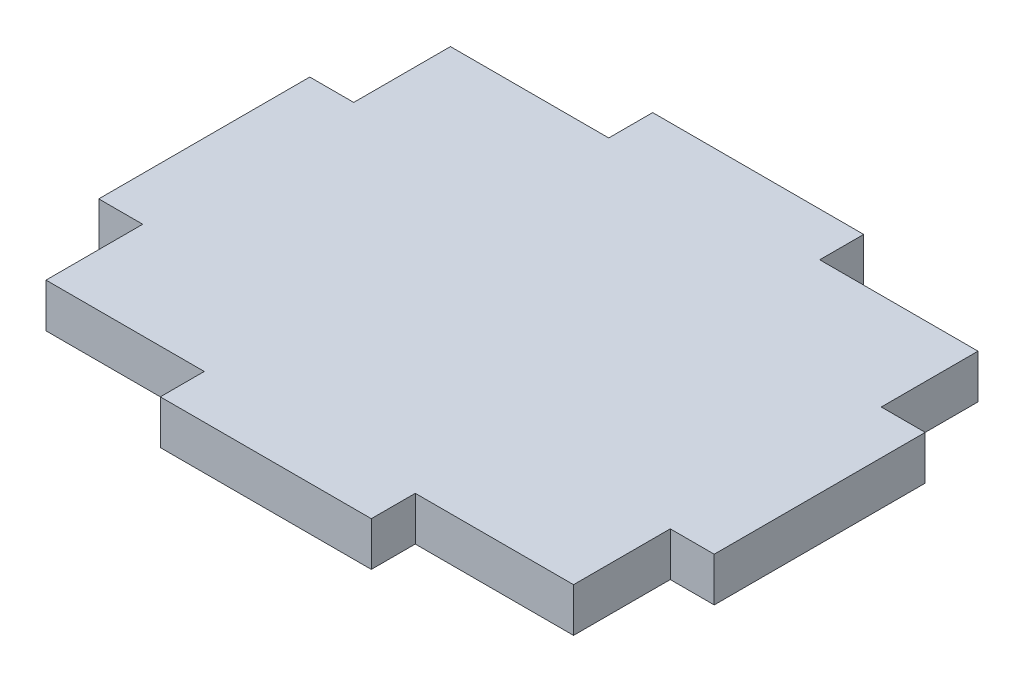
ISO-10303-21;
HEADER;
FILE_DESCRIPTION(('STEP AP214'),'2;1');
FILE_NAME('part.step','',(''),(''),'','','');
FILE_SCHEMA(('AUTOMOTIVE_DESIGN { 1 0 10303 214 1 1 1 1 }'));
ENDSEC;
DATA;
#1=APPLICATION_CONTEXT('core data for automotive mechanical design processes');
#2=APPLICATION_PROTOCOL_DEFINITION('international standard','automotive_design',2000,#1);
#3=PRODUCT_CONTEXT('',#1,'mechanical');
#4=PRODUCT('Part','Part','',(#3));
#5=PRODUCT_RELATED_PRODUCT_CATEGORY('part','',(#4));
#6=PRODUCT_DEFINITION_FORMATION('','',#4);
#7=PRODUCT_DEFINITION_CONTEXT('part definition',#1,'design');
#8=PRODUCT_DEFINITION('design','',#6,#7);
#9=PRODUCT_DEFINITION_SHAPE('','',#8);
#10=(LENGTH_UNIT() NAMED_UNIT(*) SI_UNIT(.MILLI.,.METRE.));
#11=(NAMED_UNIT(*) PLANE_ANGLE_UNIT() SI_UNIT($,.RADIAN.));
#12=(NAMED_UNIT(*) SI_UNIT($,.STERADIAN.) SOLID_ANGLE_UNIT());
#13=UNCERTAINTY_MEASURE_WITH_UNIT(LENGTH_MEASURE(1.E-05),#10,'distance_accuracy_value','');
#14=(GEOMETRIC_REPRESENTATION_CONTEXT(3) GLOBAL_UNCERTAINTY_ASSIGNED_CONTEXT((#13)) GLOBAL_UNIT_ASSIGNED_CONTEXT((#10,
#11,#12)) REPRESENTATION_CONTEXT('',''));
#15=CARTESIAN_POINT('',(0.,0.,0.));
#16=DIRECTION('',(0.,0.,1.));
#17=DIRECTION('',(1.,0.,0.));
#18=AXIS2_PLACEMENT_3D('',#15,#16,#17);
#19=CARTESIAN_POINT('',(0.,6.35,0.));
#20=DIRECTION('',(-1.,0.,0.));
#21=DIRECTION('',(0.,0.,1.));
#22=AXIS2_PLACEMENT_3D('',#19,#20,#21);
#23=PLANE('',#22);
#24=DIRECTION('',(0.,1.,0.));
#25=VECTOR('',#24,1.);
#26=CARTESIAN_POINT('',(0.,0.,13.97));
#27=LINE('',#26,#25);
#28=CARTESIAN_POINT('',(0.,0.,13.97));
#29=VERTEX_POINT('',#28);
#30=CARTESIAN_POINT('',(0.,6.35,13.97));
#31=VERTEX_POINT('',#30);
#32=EDGE_CURVE('E381',#29,#31,#27,.T.);
#33=ORIENTED_EDGE('',*,*,#32,.F.);
#34=DIRECTION('',(0.,0.,-1.));
#35=VECTOR('',#34,1.);
#36=CARTESIAN_POINT('',(0.,0.,0.));
#37=LINE('',#36,#35);
#38=CARTESIAN_POINT('',(0.,0.,0.));
#39=VERTEX_POINT('',#38);
#40=EDGE_CURVE('E204',#29,#39,#37,.T.);
#41=ORIENTED_EDGE('',*,*,#40,.T.);
#42=DIRECTION('',(0.,-1.,0.));
#43=VECTOR('',#42,1.);
#44=CARTESIAN_POINT('',(0.,6.35,0.));
#45=LINE('',#44,#43);
#46=CARTESIAN_POINT('',(0.,6.35,0.));
#47=VERTEX_POINT('',#46);
#48=EDGE_CURVE('E11',#47,#39,#45,.T.);
#49=ORIENTED_EDGE('',*,*,#48,.F.);
#50=DIRECTION('',(0.,0.,-1.));
#51=VECTOR('',#50,1.);
#52=CARTESIAN_POINT('',(0.,6.35,0.));
#53=LINE('',#52,#51);
#54=EDGE_CURVE('E227',#31,#47,#53,.T.);
#55=ORIENTED_EDGE('',*,*,#54,.F.);
#56=EDGE_LOOP('',(#33,#41,#49,#55));
#57=FACE_BOUND('',#56,.T.);
#58=ADVANCED_FACE('F39',(#57),#23,.F.);
#59=CARTESIAN_POINT('',(0.,6.35,0.));
#60=DIRECTION('',(0.,0.,1.));
#61=DIRECTION('',(1.,0.,0.));
#62=AXIS2_PLACEMENT_3D('',#59,#60,#61);
#63=PLANE('',#62);
#64=DIRECTION('',(0.,1.,0.));
#65=VECTOR('',#64,1.);
#66=CARTESIAN_POINT('',(-53.34,0.,0.));
#67=LINE('',#66,#65);
#68=CARTESIAN_POINT('',(-53.34,0.,0.));
#69=VERTEX_POINT('',#68);
#70=CARTESIAN_POINT('',(-53.34,6.35,0.));
#71=VERTEX_POINT('',#70);
#72=EDGE_CURVE('E266',#69,#71,#67,.T.);
#73=ORIENTED_EDGE('',*,*,#72,.F.);
#74=DIRECTION('',(-1.,0.,0.));
#75=VECTOR('',#74,1.);
#76=CARTESIAN_POINT('',(0.,0.,0.));
#77=LINE('',#76,#75);
#78=CARTESIAN_POINT('',(-76.2,0.,0.));
#79=VERTEX_POINT('',#78);
#80=EDGE_CURVE('E203',#69,#79,#77,.T.);
#81=ORIENTED_EDGE('',*,*,#80,.T.);
#82=DIRECTION('',(0.,-1.,0.));
#83=VECTOR('',#82,1.);
#84=CARTESIAN_POINT('',(-76.2,6.35,0.));
#85=LINE('',#84,#83);
#86=CARTESIAN_POINT('',(-76.2,6.35,0.));
#87=VERTEX_POINT('',#86);
#88=EDGE_CURVE('E48',#87,#79,#85,.T.);
#89=ORIENTED_EDGE('',*,*,#88,.F.);
#90=DIRECTION('',(-1.,0.,0.));
#91=VECTOR('',#90,1.);
#92=CARTESIAN_POINT('',(0.,6.35,0.));
#93=LINE('',#92,#91);
#94=EDGE_CURVE('E329',#71,#87,#93,.T.);
#95=ORIENTED_EDGE('',*,*,#94,.F.);
#96=EDGE_LOOP('',(#73,#81,#89,#95));
#97=FACE_BOUND('',#96,.T.);
#98=ADVANCED_FACE('F424',(#97),#63,.F.);
#99=CARTESIAN_POINT('',(-76.2,6.35,0.));
#100=DIRECTION('',(1.,0.,0.));
#101=DIRECTION('',(0.,0.,-1.));
#102=AXIS2_PLACEMENT_3D('',#99,#100,#101);
#103=PLANE('',#102);
#104=DIRECTION('',(0.,1.,0.));
#105=VECTOR('',#104,1.);
#106=CARTESIAN_POINT('',(-76.2,0.,44.45));
#107=LINE('',#106,#105);
#108=CARTESIAN_POINT('',(-76.2,0.,44.45));
#109=VERTEX_POINT('',#108);
#110=CARTESIAN_POINT('',(-76.2,6.35,44.45));
#111=VERTEX_POINT('',#110);
#112=EDGE_CURVE('E280',#109,#111,#107,.T.);
#113=ORIENTED_EDGE('',*,*,#112,.F.);
#114=DIRECTION('',(0.,0.,1.));
#115=VECTOR('',#114,1.);
#116=CARTESIAN_POINT('',(-76.2,0.,0.));
#117=LINE('',#116,#115);
#118=CARTESIAN_POINT('',(-76.2,0.,58.42));
#119=VERTEX_POINT('',#118);
#120=EDGE_CURVE('E217',#109,#119,#117,.T.);
#121=ORIENTED_EDGE('',*,*,#120,.T.);
#122=DIRECTION('',(0.,-1.,0.));
#123=VECTOR('',#122,1.);
#124=CARTESIAN_POINT('',(-76.2,6.35,58.42));
#125=LINE('',#124,#123);
#126=CARTESIAN_POINT('',(-76.2,6.35,58.42));
#127=VERTEX_POINT('',#126);
#128=EDGE_CURVE('E230',#127,#119,#125,.T.);
#129=ORIENTED_EDGE('',*,*,#128,.F.);
#130=DIRECTION('',(0.,0.,1.));
#131=VECTOR('',#130,1.);
#132=CARTESIAN_POINT('',(-76.2,6.35,0.));
#133=LINE('',#132,#131);
#134=EDGE_CURVE('E333',#111,#127,#133,.T.);
#135=ORIENTED_EDGE('',*,*,#134,.F.);
#136=EDGE_LOOP('',(#113,#121,#129,#135));
#137=FACE_BOUND('',#136,.T.);
#138=ADVANCED_FACE('F347',(#137),#103,.F.);
#139=CARTESIAN_POINT('',(0.,6.35,58.42));
#140=DIRECTION('',(0.,0.,-1.));
#141=DIRECTION('',(-1.,0.,0.));
#142=AXIS2_PLACEMENT_3D('',#139,#140,#141);
#143=PLANE('',#142);
#144=DIRECTION('',(0.,1.,0.));
#145=VECTOR('',#144,1.);
#146=CARTESIAN_POINT('',(-22.86,0.,58.42));
#147=LINE('',#146,#145);
#148=CARTESIAN_POINT('',(-22.86,0.,58.42));
#149=VERTEX_POINT('',#148);
#150=CARTESIAN_POINT('',(-22.86,6.35,58.42));
#151=VERTEX_POINT('',#150);
#152=EDGE_CURVE('E304',#149,#151,#147,.T.);
#153=ORIENTED_EDGE('',*,*,#152,.F.);
#154=DIRECTION('',(1.,0.,0.));
#155=VECTOR('',#154,1.);
#156=CARTESIAN_POINT('',(0.,0.,58.42));
#157=LINE('',#156,#155);
#158=CARTESIAN_POINT('',(0.,0.,58.42));
#159=VERTEX_POINT('',#158);
#160=EDGE_CURVE('E222',#149,#159,#157,.T.);
#161=ORIENTED_EDGE('',*,*,#160,.T.);
#162=DIRECTION('',(0.,-1.,0.));
#163=VECTOR('',#162,1.);
#164=CARTESIAN_POINT('',(0.,6.35,58.42));
#165=LINE('',#164,#163);
#166=CARTESIAN_POINT('',(0.,6.35,58.42));
#167=VERTEX_POINT('',#166);
#168=EDGE_CURVE('E201',#167,#159,#165,.T.);
#169=ORIENTED_EDGE('',*,*,#168,.F.);
#170=DIRECTION('',(1.,0.,0.));
#171=VECTOR('',#170,1.);
#172=CARTESIAN_POINT('',(0.,6.35,58.42));
#173=LINE('',#172,#171);
#174=EDGE_CURVE('E335',#151,#167,#173,.T.);
#175=ORIENTED_EDGE('',*,*,#174,.F.);
#176=EDGE_LOOP('',(#153,#161,#169,#175));
#177=FACE_BOUND('',#176,.T.);
#178=ADVANCED_FACE('F366',(#177),#143,.F.);
#179=CARTESIAN_POINT('',(0.,0.,44.45));
#180=VERTEX_POINT('',#179);
#181=EDGE_CURVE('E192',#159,#180,#37,.T.);
#182=ORIENTED_EDGE('',*,*,#181,.T.);
#183=DIRECTION('',(0.,1.,0.));
#184=VECTOR('',#183,1.);
#185=CARTESIAN_POINT('',(0.,0.,44.45));
#186=LINE('',#185,#184);
#187=CARTESIAN_POINT('',(0.,6.35,44.45));
#188=VERTEX_POINT('',#187);
#189=EDGE_CURVE('E175',#180,#188,#186,.T.);
#190=ORIENTED_EDGE('',*,*,#189,.T.);
#191=EDGE_CURVE('E326',#167,#188,#53,.T.);
#192=ORIENTED_EDGE('',*,*,#191,.F.);
#193=ORIENTED_EDGE('',*,*,#168,.T.);
#194=EDGE_LOOP('',(#182,#190,#192,#193));
#195=FACE_BOUND('',#194,.T.);
#196=ADVANCED_FACE('F41',(#195),#23,.F.);
#197=CARTESIAN_POINT('',(-22.86,0.,0.));
#198=VERTEX_POINT('',#197);
#199=EDGE_CURVE('E208',#39,#198,#77,.T.);
#200=ORIENTED_EDGE('',*,*,#199,.T.);
#201=DIRECTION('',(0.,1.,0.));
#202=VECTOR('',#201,1.);
#203=CARTESIAN_POINT('',(-22.86,0.,0.));
#204=LINE('',#203,#202);
#205=CARTESIAN_POINT('',(-22.86,6.35,0.));
#206=VERTEX_POINT('',#205);
#207=EDGE_CURVE('E414',#198,#206,#204,.T.);
#208=ORIENTED_EDGE('',*,*,#207,.T.);
#209=EDGE_CURVE('E330',#47,#206,#93,.T.);
#210=ORIENTED_EDGE('',*,*,#209,.F.);
#211=ORIENTED_EDGE('',*,*,#48,.T.);
#212=EDGE_LOOP('',(#200,#208,#210,#211));
#213=FACE_BOUND('',#212,.T.);
#214=ADVANCED_FACE('F433',(#213),#63,.F.);
#215=CARTESIAN_POINT('',(-76.2,0.,13.97));
#216=VERTEX_POINT('',#215);
#217=EDGE_CURVE('E218',#79,#216,#117,.T.);
#218=ORIENTED_EDGE('',*,*,#217,.T.);
#219=DIRECTION('',(0.,1.,0.));
#220=VECTOR('',#219,1.);
#221=CARTESIAN_POINT('',(-76.2,0.,13.97));
#222=LINE('',#221,#220);
#223=CARTESIAN_POINT('',(-76.2,6.35,13.97));
#224=VERTEX_POINT('',#223);
#225=EDGE_CURVE('E271',#216,#224,#222,.T.);
#226=ORIENTED_EDGE('',*,*,#225,.T.);
#227=EDGE_CURVE('E242',#87,#224,#133,.T.);
#228=ORIENTED_EDGE('',*,*,#227,.F.);
#229=ORIENTED_EDGE('',*,*,#88,.T.);
#230=EDGE_LOOP('',(#218,#226,#228,#229));
#231=FACE_BOUND('',#230,.T.);
#232=ADVANCED_FACE('F239',(#231),#103,.F.);
#233=CARTESIAN_POINT('',(-53.34,0.,58.42));
#234=VERTEX_POINT('',#233);
#235=EDGE_CURVE('E223',#119,#234,#157,.T.);
#236=ORIENTED_EDGE('',*,*,#235,.T.);
#237=DIRECTION('',(0.,1.,0.));
#238=VECTOR('',#237,1.);
#239=CARTESIAN_POINT('',(-53.34,0.,58.42));
#240=LINE('',#239,#238);
#241=CARTESIAN_POINT('',(-53.34,6.35,58.42));
#242=VERTEX_POINT('',#241);
#243=EDGE_CURVE('E320',#234,#242,#240,.T.);
#244=ORIENTED_EDGE('',*,*,#243,.T.);
#245=EDGE_CURVE('E212',#127,#242,#173,.T.);
#246=ORIENTED_EDGE('',*,*,#245,.F.);
#247=ORIENTED_EDGE('',*,*,#128,.T.);
#248=EDGE_LOOP('',(#236,#244,#246,#247));
#249=FACE_BOUND('',#248,.T.);
#250=ADVANCED_FACE('F351',(#249),#143,.F.);
#251=CARTESIAN_POINT('',(0.,6.35,0.));
#252=DIRECTION('',(0.,-1.,0.));
#253=DIRECTION('',(0.,0.,-1.));
#254=AXIS2_PLACEMENT_3D('',#251,#252,#253);
#255=PLANE('',#254);
#256=ORIENTED_EDGE('',*,*,#191,.T.);
#257=DIRECTION('',(1.,0.,0.));
#258=VECTOR('',#257,1.);
#259=CARTESIAN_POINT('',(0.,6.35,44.45));
#260=LINE('',#259,#258);
#261=CARTESIAN_POINT('',(6.35,6.35,44.45));
#262=VERTEX_POINT('',#261);
#263=EDGE_CURVE('E55',#188,#262,#260,.T.);
#264=ORIENTED_EDGE('',*,*,#263,.T.);
#265=DIRECTION('',(0.,0.,-1.));
#266=VECTOR('',#265,1.);
#267=CARTESIAN_POINT('',(6.35,6.35,44.45));
#268=LINE('',#267,#266);
#269=CARTESIAN_POINT('',(6.34999999999999,6.35,13.97));
#270=VERTEX_POINT('',#269);
#271=EDGE_CURVE('E370',#262,#270,#268,.T.);
#272=ORIENTED_EDGE('',*,*,#271,.T.);
#273=DIRECTION('',(-1.,0.,0.));
#274=VECTOR('',#273,1.);
#275=CARTESIAN_POINT('',(0.,6.35,13.97));
#276=LINE('',#275,#274);
#277=EDGE_CURVE('E197',#270,#31,#276,.T.);
#278=ORIENTED_EDGE('',*,*,#277,.T.);
#279=ORIENTED_EDGE('',*,*,#54,.T.);
#280=ORIENTED_EDGE('',*,*,#209,.T.);
#281=DIRECTION('',(0.,0.,-1.));
#282=VECTOR('',#281,1.);
#283=CARTESIAN_POINT('',(-22.86,6.35,0.));
#284=LINE('',#283,#282);
#285=CARTESIAN_POINT('',(-22.86,6.35,-6.35));
#286=VERTEX_POINT('',#285);
#287=EDGE_CURVE('E63',#206,#286,#284,.T.);
#288=ORIENTED_EDGE('',*,*,#287,.T.);
#289=DIRECTION('',(-1.,0.,0.));
#290=VECTOR('',#289,1.);
#291=CARTESIAN_POINT('',(-53.34,6.35,-6.35));
#292=LINE('',#291,#290);
#293=CARTESIAN_POINT('',(-53.34,6.35,-6.35));
#294=VERTEX_POINT('',#293);
#295=EDGE_CURVE('E394',#286,#294,#292,.T.);
#296=ORIENTED_EDGE('',*,*,#295,.T.);
#297=DIRECTION('',(0.,0.,1.));
#298=VECTOR('',#297,1.);
#299=CARTESIAN_POINT('',(-53.34,6.35,0.));
#300=LINE('',#299,#298);
#301=EDGE_CURVE('E384',#294,#71,#300,.T.);
#302=ORIENTED_EDGE('',*,*,#301,.T.);
#303=ORIENTED_EDGE('',*,*,#94,.T.);
#304=ORIENTED_EDGE('',*,*,#227,.T.);
#305=DIRECTION('',(-1.,0.,0.));
#306=VECTOR('',#305,1.);
#307=CARTESIAN_POINT('',(-76.2,6.35,13.97));
#308=LINE('',#307,#306);
#309=CARTESIAN_POINT('',(-82.55,6.35,13.97));
#310=VERTEX_POINT('',#309);
#311=EDGE_CURVE('E272',#224,#310,#308,.T.);
#312=ORIENTED_EDGE('',*,*,#311,.T.);
#313=DIRECTION('',(0.,0.,1.));
#314=VECTOR('',#313,1.);
#315=CARTESIAN_POINT('',(-82.55,6.35,44.45));
#316=LINE('',#315,#314);
#317=CARTESIAN_POINT('',(-82.55,6.35,44.45));
#318=VERTEX_POINT('',#317);
#319=EDGE_CURVE('E263',#310,#318,#316,.T.);
#320=ORIENTED_EDGE('',*,*,#319,.T.);
#321=DIRECTION('',(1.,0.,0.));
#322=VECTOR('',#321,1.);
#323=CARTESIAN_POINT('',(-76.2,6.35,44.45));
#324=LINE('',#323,#322);
#325=EDGE_CURVE('E256',#318,#111,#324,.T.);
#326=ORIENTED_EDGE('',*,*,#325,.T.);
#327=ORIENTED_EDGE('',*,*,#134,.T.);
#328=ORIENTED_EDGE('',*,*,#245,.T.);
#329=DIRECTION('',(0.,0.,1.));
#330=VECTOR('',#329,1.);
#331=CARTESIAN_POINT('',(-53.34,6.35,58.42));
#332=LINE('',#331,#330);
#333=CARTESIAN_POINT('',(-53.34,6.35,64.77));
#334=VERTEX_POINT('',#333);
#335=EDGE_CURVE('E308',#242,#334,#332,.T.);
#336=ORIENTED_EDGE('',*,*,#335,.T.);
#337=DIRECTION('',(1.,0.,0.));
#338=VECTOR('',#337,1.);
#339=CARTESIAN_POINT('',(-22.86,6.35,64.77));
#340=LINE('',#339,#338);
#341=CARTESIAN_POINT('',(-22.86,6.35,64.77));
#342=VERTEX_POINT('',#341);
#343=EDGE_CURVE('E296',#334,#342,#340,.T.);
#344=ORIENTED_EDGE('',*,*,#343,.T.);
#345=DIRECTION('',(0.,0.,-1.));
#346=VECTOR('',#345,1.);
#347=CARTESIAN_POINT('',(-22.86,6.35,58.42));
#348=LINE('',#347,#346);
#349=EDGE_CURVE('E283',#342,#151,#348,.T.);
#350=ORIENTED_EDGE('',*,*,#349,.T.);
#351=ORIENTED_EDGE('',*,*,#174,.T.);
#352=EDGE_LOOP('',(#256,#264,#272,#278,#279,#280,#288,#296,#302,#303,#304,#312,#320,#326,#327,
#328,#336,#344,#350,#351));
#353=FACE_BOUND('',#352,.T.);
#354=ADVANCED_FACE('F342',(#353),#255,.F.);
#355=CARTESIAN_POINT('',(0.,0.,0.));
#356=DIRECTION('',(0.,-1.,0.));
#357=DIRECTION('',(0.,0.,-1.));
#358=AXIS2_PLACEMENT_3D('',#355,#356,#357);
#359=PLANE('',#358);
#360=ORIENTED_EDGE('',*,*,#181,.F.);
#361=ORIENTED_EDGE('',*,*,#160,.F.);
#362=DIRECTION('',(0.,0.,-1.));
#363=VECTOR('',#362,1.);
#364=CARTESIAN_POINT('',(-22.86,0.,58.42));
#365=LINE('',#364,#363);
#366=CARTESIAN_POINT('',(-22.86,0.,64.77));
#367=VERTEX_POINT('',#366);
#368=EDGE_CURVE('E292',#367,#149,#365,.T.);
#369=ORIENTED_EDGE('',*,*,#368,.F.);
#370=DIRECTION('',(1.,0.,0.));
#371=VECTOR('',#370,1.);
#372=CARTESIAN_POINT('',(-22.86,0.,64.77));
#373=LINE('',#372,#371);
#374=CARTESIAN_POINT('',(-53.34,0.,64.77));
#375=VERTEX_POINT('',#374);
#376=EDGE_CURVE('E300',#375,#367,#373,.T.);
#377=ORIENTED_EDGE('',*,*,#376,.F.);
#378=DIRECTION('',(0.,0.,1.));
#379=VECTOR('',#378,1.);
#380=CARTESIAN_POINT('',(-53.34,0.,58.42));
#381=LINE('',#380,#379);
#382=EDGE_CURVE('E295',#234,#375,#381,.T.);
#383=ORIENTED_EDGE('',*,*,#382,.F.);
#384=ORIENTED_EDGE('',*,*,#235,.F.);
#385=ORIENTED_EDGE('',*,*,#120,.F.);
#386=DIRECTION('',(1.,0.,0.));
#387=VECTOR('',#386,1.);
#388=CARTESIAN_POINT('',(-76.2,0.,44.45));
#389=LINE('',#388,#387);
#390=CARTESIAN_POINT('',(-82.55,0.,44.45));
#391=VERTEX_POINT('',#390);
#392=EDGE_CURVE('E260',#391,#109,#389,.T.);
#393=ORIENTED_EDGE('',*,*,#392,.F.);
#394=DIRECTION('',(0.,0.,1.));
#395=VECTOR('',#394,1.);
#396=CARTESIAN_POINT('',(-82.55,0.,44.45));
#397=LINE('',#396,#395);
#398=CARTESIAN_POINT('',(-82.55,0.,13.97));
#399=VERTEX_POINT('',#398);
#400=EDGE_CURVE('E253',#399,#391,#397,.T.);
#401=ORIENTED_EDGE('',*,*,#400,.F.);
#402=DIRECTION('',(-1.,0.,0.));
#403=VECTOR('',#402,1.);
#404=CARTESIAN_POINT('',(-76.2,0.,13.97));
#405=LINE('',#404,#403);
#406=EDGE_CURVE('E250',#216,#399,#405,.T.);
#407=ORIENTED_EDGE('',*,*,#406,.F.);
#408=ORIENTED_EDGE('',*,*,#217,.F.);
#409=ORIENTED_EDGE('',*,*,#80,.F.);
#410=DIRECTION('',(0.,0.,1.));
#411=VECTOR('',#410,1.);
#412=CARTESIAN_POINT('',(-53.34,0.,0.));
#413=LINE('',#412,#411);
#414=CARTESIAN_POINT('',(-53.34,0.,-6.35));
#415=VERTEX_POINT('',#414);
#416=EDGE_CURVE('E390',#415,#69,#413,.T.);
#417=ORIENTED_EDGE('',*,*,#416,.F.);
#418=DIRECTION('',(-1.,0.,0.));
#419=VECTOR('',#418,1.);
#420=CARTESIAN_POINT('',(-53.34,0.,-6.35));
#421=LINE('',#420,#419);
#422=CARTESIAN_POINT('',(-22.86,0.,-6.35));
#423=VERTEX_POINT('',#422);
#424=EDGE_CURVE('E398',#423,#415,#421,.T.);
#425=ORIENTED_EDGE('',*,*,#424,.F.);
#426=DIRECTION('',(0.,0.,-1.));
#427=VECTOR('',#426,1.);
#428=CARTESIAN_POINT('',(-22.86,0.,0.));
#429=LINE('',#428,#427);
#430=EDGE_CURVE('E393',#198,#423,#429,.T.);
#431=ORIENTED_EDGE('',*,*,#430,.F.);
#432=ORIENTED_EDGE('',*,*,#199,.F.);
#433=ORIENTED_EDGE('',*,*,#40,.F.);
#434=DIRECTION('',(-1.,0.,0.));
#435=VECTOR('',#434,1.);
#436=CARTESIAN_POINT('',(0.,0.,13.97));
#437=LINE('',#436,#435);
#438=CARTESIAN_POINT('',(6.34999999999999,0.,13.97));
#439=VERTEX_POINT('',#438);
#440=EDGE_CURVE('E185',#439,#29,#437,.T.);
#441=ORIENTED_EDGE('',*,*,#440,.F.);
#442=DIRECTION('',(0.,0.,-1.));
#443=VECTOR('',#442,1.);
#444=CARTESIAN_POINT('',(6.35,0.,44.45));
#445=LINE('',#444,#443);
#446=CARTESIAN_POINT('',(6.35,0.,44.45));
#447=VERTEX_POINT('',#446);
#448=EDGE_CURVE('E195',#447,#439,#445,.T.);
#449=ORIENTED_EDGE('',*,*,#448,.F.);
#450=DIRECTION('',(1.,0.,0.));
#451=VECTOR('',#450,1.);
#452=CARTESIAN_POINT('',(0.,0.,44.45));
#453=LINE('',#452,#451);
#454=EDGE_CURVE('E178',#180,#447,#453,.T.);
#455=ORIENTED_EDGE('',*,*,#454,.F.);
#456=EDGE_LOOP('',(#360,#361,#369,#377,#383,#384,#385,#393,#401,#407,#408,#409,#417,#425,#431,
#432,#433,#441,#449,#455));
#457=FACE_BOUND('',#456,.T.);
#458=ADVANCED_FACE('F190',(#457),#359,.T.);
#459=CARTESIAN_POINT('',(-22.86,0.,58.42));
#460=DIRECTION('',(1.,0.,0.));
#461=DIRECTION('',(0.,0.,-1.));
#462=AXIS2_PLACEMENT_3D('',#459,#460,#461);
#463=PLANE('',#462);
#464=ORIENTED_EDGE('',*,*,#349,.F.);
#465=DIRECTION('',(0.,1.,0.));
#466=VECTOR('',#465,1.);
#467=CARTESIAN_POINT('',(-22.86,0.,64.77));
#468=LINE('',#467,#466);
#469=EDGE_CURVE('E210',#367,#342,#468,.T.);
#470=ORIENTED_EDGE('',*,*,#469,.F.);
#471=ORIENTED_EDGE('',*,*,#368,.T.);
#472=ORIENTED_EDGE('',*,*,#152,.T.);
#473=EDGE_LOOP('',(#464,#470,#471,#472));
#474=FACE_BOUND('',#473,.T.);
#475=ADVANCED_FACE('F532',(#474),#463,.T.);
#476=CARTESIAN_POINT('',(-22.86,0.,64.77));
#477=DIRECTION('',(0.,0.,1.));
#478=DIRECTION('',(1.,0.,0.));
#479=AXIS2_PLACEMENT_3D('',#476,#477,#478);
#480=PLANE('',#479);
#481=ORIENTED_EDGE('',*,*,#343,.F.);
#482=DIRECTION('',(0.,1.,0.));
#483=VECTOR('',#482,1.);
#484=CARTESIAN_POINT('',(-53.34,0.,64.77));
#485=LINE('',#484,#483);
#486=EDGE_CURVE('E317',#375,#334,#485,.T.);
#487=ORIENTED_EDGE('',*,*,#486,.F.);
#488=ORIENTED_EDGE('',*,*,#376,.T.);
#489=ORIENTED_EDGE('',*,*,#469,.T.);
#490=EDGE_LOOP('',(#481,#487,#488,#489));
#491=FACE_BOUND('',#490,.T.);
#492=ADVANCED_FACE('F360',(#491),#480,.T.);
#493=CARTESIAN_POINT('',(-53.34,0.,58.42));
#494=DIRECTION('',(-1.,0.,0.));
#495=DIRECTION('',(0.,0.,1.));
#496=AXIS2_PLACEMENT_3D('',#493,#494,#495);
#497=PLANE('',#496);
#498=ORIENTED_EDGE('',*,*,#335,.F.);
#499=ORIENTED_EDGE('',*,*,#243,.F.);
#500=ORIENTED_EDGE('',*,*,#382,.T.);
#501=ORIENTED_EDGE('',*,*,#486,.T.);
#502=EDGE_LOOP('',(#498,#499,#500,#501));
#503=FACE_BOUND('',#502,.T.);
#504=ADVANCED_FACE('F355',(#503),#497,.T.);
#505=CARTESIAN_POINT('',(-76.2,0.,44.45));
#506=DIRECTION('',(0.,0.,1.));
#507=DIRECTION('',(1.,0.,0.));
#508=AXIS2_PLACEMENT_3D('',#505,#506,#507);
#509=PLANE('',#508);
#510=ORIENTED_EDGE('',*,*,#325,.F.);
#511=DIRECTION('',(0.,1.,0.));
#512=VECTOR('',#511,1.);
#513=CARTESIAN_POINT('',(-82.55,0.,44.45));
#514=LINE('',#513,#512);
#515=EDGE_CURVE('E284',#391,#318,#514,.T.);
#516=ORIENTED_EDGE('',*,*,#515,.F.);
#517=ORIENTED_EDGE('',*,*,#392,.T.);
#518=ORIENTED_EDGE('',*,*,#112,.T.);
#519=EDGE_LOOP('',(#510,#516,#517,#518));
#520=FACE_BOUND('',#519,.T.);
#521=ADVANCED_FACE('F564',(#520),#509,.T.);
#522=CARTESIAN_POINT('',(-82.55,0.,44.45));
#523=DIRECTION('',(-1.,0.,0.));
#524=DIRECTION('',(0.,0.,1.));
#525=AXIS2_PLACEMENT_3D('',#522,#523,#524);
#526=PLANE('',#525);
#527=ORIENTED_EDGE('',*,*,#319,.F.);
#528=DIRECTION('',(0.,1.,0.));
#529=VECTOR('',#528,1.);
#530=CARTESIAN_POINT('',(-82.55,0.,13.97));
#531=LINE('',#530,#529);
#532=EDGE_CURVE('E287',#399,#310,#531,.T.);
#533=ORIENTED_EDGE('',*,*,#532,.F.);
#534=ORIENTED_EDGE('',*,*,#400,.T.);
#535=ORIENTED_EDGE('',*,*,#515,.T.);
#536=EDGE_LOOP('',(#527,#533,#534,#535));
#537=FACE_BOUND('',#536,.T.);
#538=ADVANCED_FACE('F572',(#537),#526,.T.);
#539=CARTESIAN_POINT('',(-76.2,0.,13.97));
#540=DIRECTION('',(0.,0.,-1.));
#541=DIRECTION('',(-1.,0.,0.));
#542=AXIS2_PLACEMENT_3D('',#539,#540,#541);
#543=PLANE('',#542);
#544=ORIENTED_EDGE('',*,*,#311,.F.);
#545=ORIENTED_EDGE('',*,*,#225,.F.);
#546=ORIENTED_EDGE('',*,*,#406,.T.);
#547=ORIENTED_EDGE('',*,*,#532,.T.);
#548=EDGE_LOOP('',(#544,#545,#546,#547));
#549=FACE_BOUND('',#548,.T.);
#550=ADVANCED_FACE('F449',(#549),#543,.T.);
#551=CARTESIAN_POINT('',(-53.34,0.,0.));
#552=DIRECTION('',(-1.,0.,0.));
#553=DIRECTION('',(0.,0.,1.));
#554=AXIS2_PLACEMENT_3D('',#551,#552,#553);
#555=PLANE('',#554);
#556=ORIENTED_EDGE('',*,*,#301,.F.);
#557=DIRECTION('',(0.,1.,0.));
#558=VECTOR('',#557,1.);
#559=CARTESIAN_POINT('',(-53.34,0.,-6.35));
#560=LINE('',#559,#558);
#561=EDGE_CURVE('E276',#415,#294,#560,.T.);
#562=ORIENTED_EDGE('',*,*,#561,.F.);
#563=ORIENTED_EDGE('',*,*,#416,.T.);
#564=ORIENTED_EDGE('',*,*,#72,.T.);
#565=EDGE_LOOP('',(#556,#562,#563,#564));
#566=FACE_BOUND('',#565,.T.);
#567=ADVANCED_FACE('F422',(#566),#555,.T.);
#568=CARTESIAN_POINT('',(-53.34,0.,-6.35));
#569=DIRECTION('',(0.,0.,-1.));
#570=DIRECTION('',(-1.,0.,0.));
#571=AXIS2_PLACEMENT_3D('',#568,#569,#570);
#572=PLANE('',#571);
#573=ORIENTED_EDGE('',*,*,#295,.F.);
#574=DIRECTION('',(0.,1.,0.));
#575=VECTOR('',#574,1.);
#576=CARTESIAN_POINT('',(-22.86,0.,-6.35));
#577=LINE('',#576,#575);
#578=EDGE_CURVE('E412',#423,#286,#577,.T.);
#579=ORIENTED_EDGE('',*,*,#578,.F.);
#580=ORIENTED_EDGE('',*,*,#424,.T.);
#581=ORIENTED_EDGE('',*,*,#561,.T.);
#582=EDGE_LOOP('',(#573,#579,#580,#581));
#583=FACE_BOUND('',#582,.T.);
#584=ADVANCED_FACE('F440',(#583),#572,.T.);
#585=CARTESIAN_POINT('',(-22.86,0.,0.));
#586=DIRECTION('',(1.,0.,0.));
#587=DIRECTION('',(0.,0.,-1.));
#588=AXIS2_PLACEMENT_3D('',#585,#586,#587);
#589=PLANE('',#588);
#590=ORIENTED_EDGE('',*,*,#287,.F.);
#591=ORIENTED_EDGE('',*,*,#207,.F.);
#592=ORIENTED_EDGE('',*,*,#430,.T.);
#593=ORIENTED_EDGE('',*,*,#578,.T.);
#594=EDGE_LOOP('',(#590,#591,#592,#593));
#595=FACE_BOUND('',#594,.T.);
#596=ADVANCED_FACE('F438',(#595),#589,.T.);
#597=CARTESIAN_POINT('',(0.,0.,13.97));
#598=DIRECTION('',(0.,0.,-1.));
#599=DIRECTION('',(-1.,0.,0.));
#600=AXIS2_PLACEMENT_3D('',#597,#598,#599);
#601=PLANE('',#600);
#602=ORIENTED_EDGE('',*,*,#277,.F.);
#603=DIRECTION('',(0.,1.,0.));
#604=VECTOR('',#603,1.);
#605=CARTESIAN_POINT('',(6.34999999999999,0.,13.97));
#606=LINE('',#605,#604);
#607=EDGE_CURVE('E385',#439,#270,#606,.T.);
#608=ORIENTED_EDGE('',*,*,#607,.F.);
#609=ORIENTED_EDGE('',*,*,#440,.T.);
#610=ORIENTED_EDGE('',*,*,#32,.T.);
#611=EDGE_LOOP('',(#602,#608,#609,#610));
#612=FACE_BOUND('',#611,.T.);
#613=ADVANCED_FACE('F447',(#612),#601,.T.);
#614=CARTESIAN_POINT('',(6.35,0.,44.45));
#615=DIRECTION('',(1.,0.,0.));
#616=DIRECTION('',(0.,0.,-1.));
#617=AXIS2_PLACEMENT_3D('',#614,#615,#616);
#618=PLANE('',#617);
#619=ORIENTED_EDGE('',*,*,#271,.F.);
#620=DIRECTION('',(0.,1.,0.));
#621=VECTOR('',#620,1.);
#622=CARTESIAN_POINT('',(6.35,0.,44.45));
#623=LINE('',#622,#621);
#624=EDGE_CURVE('E184',#447,#262,#623,.T.);
#625=ORIENTED_EDGE('',*,*,#624,.F.);
#626=ORIENTED_EDGE('',*,*,#448,.T.);
#627=ORIENTED_EDGE('',*,*,#607,.T.);
#628=EDGE_LOOP('',(#619,#625,#626,#627));
#629=FACE_BOUND('',#628,.T.);
#630=ADVANCED_FACE('F610',(#629),#618,.T.);
#631=CARTESIAN_POINT('',(0.,0.,44.45));
#632=DIRECTION('',(0.,0.,1.));
#633=DIRECTION('',(1.,0.,0.));
#634=AXIS2_PLACEMENT_3D('',#631,#632,#633);
#635=PLANE('',#634);
#636=ORIENTED_EDGE('',*,*,#263,.F.);
#637=ORIENTED_EDGE('',*,*,#189,.F.);
#638=ORIENTED_EDGE('',*,*,#454,.T.);
#639=ORIENTED_EDGE('',*,*,#624,.T.);
#640=EDGE_LOOP('',(#636,#637,#638,#639));
#641=FACE_BOUND('',#640,.T.);
#642=ADVANCED_FACE('F177',(#641),#635,.T.);
#643=CLOSED_SHELL('',(#58,#98,#138,#178,#196,#214,#232,#250,#354,#458,#475,#492,#504,#521,#538,
#550,#567,#584,#596,#613,#630,#642));
#644=MANIFOLD_SOLID_BREP('B2',#643);
#645=ADVANCED_BREP_SHAPE_REPRESENTATION('',(#18,#644),#14);
#646=SHAPE_DEFINITION_REPRESENTATION(#9,#645);
ENDSEC;
END-ISO-10303-21;
